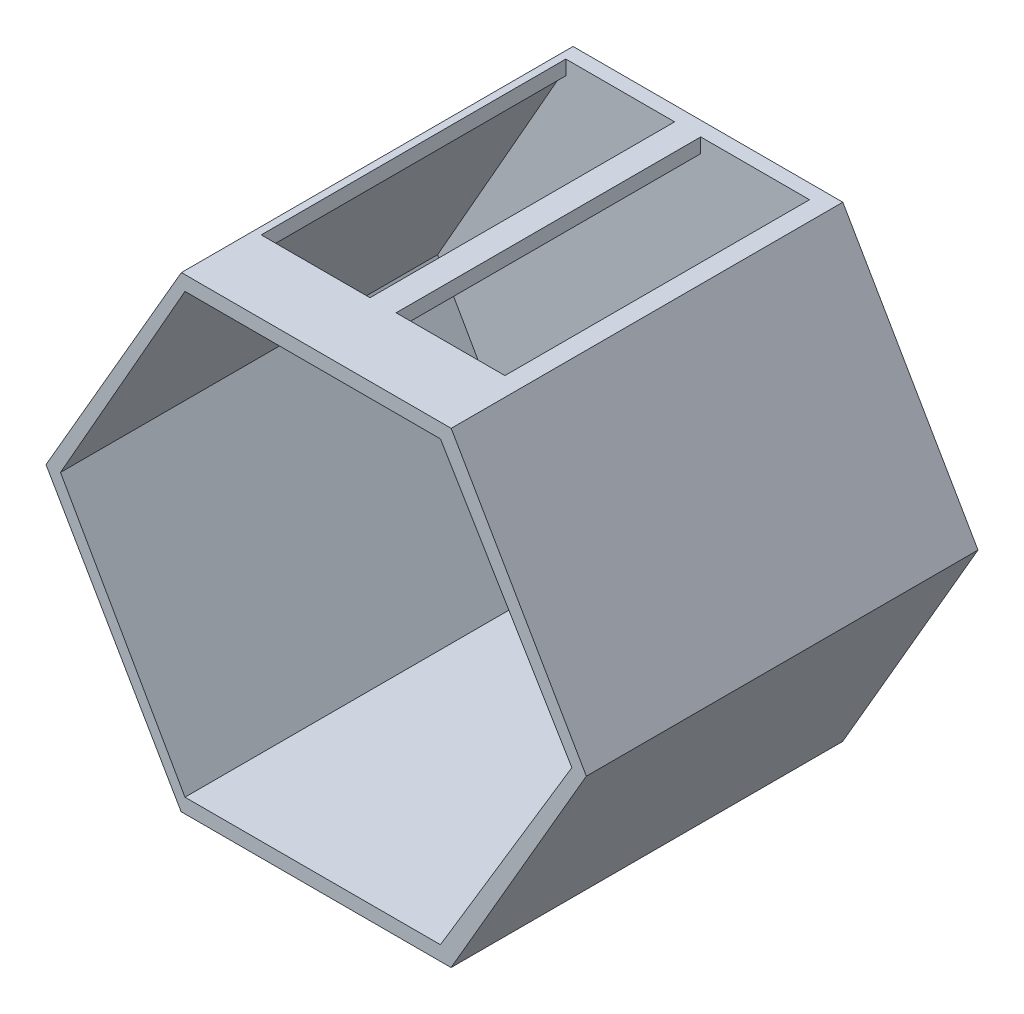
ISO-10303-21;
HEADER;
FILE_DESCRIPTION(('STEP AP214'),'2;1');
FILE_NAME('part.step','',(''),(''),'','','');
FILE_SCHEMA(('AUTOMOTIVE_DESIGN { 1 0 10303 214 1 1 1 1 }'));
ENDSEC;
DATA;
#1=APPLICATION_CONTEXT('core data for automotive mechanical design processes');
#2=APPLICATION_PROTOCOL_DEFINITION('international standard','automotive_design',2000,#1);
#3=PRODUCT_CONTEXT('',#1,'mechanical');
#4=PRODUCT('Part','Part','',(#3));
#5=PRODUCT_RELATED_PRODUCT_CATEGORY('part','',(#4));
#6=PRODUCT_DEFINITION_FORMATION('','',#4);
#7=PRODUCT_DEFINITION_CONTEXT('part definition',#1,'design');
#8=PRODUCT_DEFINITION('design','',#6,#7);
#9=PRODUCT_DEFINITION_SHAPE('','',#8);
#10=(LENGTH_UNIT() NAMED_UNIT(*) SI_UNIT(.MILLI.,.METRE.));
#11=(NAMED_UNIT(*) PLANE_ANGLE_UNIT() SI_UNIT($,.RADIAN.));
#12=(NAMED_UNIT(*) SI_UNIT($,.STERADIAN.) SOLID_ANGLE_UNIT());
#13=UNCERTAINTY_MEASURE_WITH_UNIT(LENGTH_MEASURE(1.E-05),#10,'distance_accuracy_value','');
#14=(GEOMETRIC_REPRESENTATION_CONTEXT(3) GLOBAL_UNCERTAINTY_ASSIGNED_CONTEXT((#13)) GLOBAL_UNIT_ASSIGNED_CONTEXT((#10,
#11,#12)) REPRESENTATION_CONTEXT('',''));
#15=CARTESIAN_POINT('',(0.,0.,0.));
#16=DIRECTION('',(0.,0.,1.));
#17=DIRECTION('',(1.,0.,0.));
#18=AXIS2_PLACEMENT_3D('',#15,#16,#17);
#19=CARTESIAN_POINT('',(928.607799475483,-1610.,0.));
#20=DIRECTION('',(0.865126276195594,-0.501554110975022,0.));
#21=DIRECTION('',(0.501554110975022,0.865126276195594,0.));
#22=AXIS2_PLACEMENT_3D('',#19,#20,#21);
#23=PLANE('',#22);
#24=DIRECTION('',(0.501554110975022,0.865126276195594,0.));
#25=VECTOR('',#24,1.);
#26=CARTESIAN_POINT('',(1395.05363222758,-805.431684227843,2700.));
#27=LINE('',#26,#25);
#28=CARTESIAN_POINT('',(928.607799475483,-1610.,2700.));
#29=VERTEX_POINT('',#28);
#30=CARTESIAN_POINT('',(1861.49946497968,-0.863368455684849,2700.));
#31=VERTEX_POINT('',#30);
#32=EDGE_CURVE('E9',#29,#31,#27,.T.);
#33=ORIENTED_EDGE('',*,*,#32,.F.);
#34=DIRECTION('',(0.,0.,1.));
#35=VECTOR('',#34,1.);
#36=CARTESIAN_POINT('',(928.607799475483,-1610.,1350.));
#37=LINE('',#36,#35);
#38=CARTESIAN_POINT('',(928.607799475483,-1610.,0.));
#39=VERTEX_POINT('',#38);
#40=EDGE_CURVE('E26',#39,#29,#37,.T.);
#41=ORIENTED_EDGE('',*,*,#40,.F.);
#42=DIRECTION('',(0.501554110975022,0.865126276195594,0.));
#43=VECTOR('',#42,1.);
#44=CARTESIAN_POINT('',(1395.05363222758,-805.431684227843,0.));
#45=LINE('',#44,#43);
#46=CARTESIAN_POINT('',(1861.49946497968,-0.863368455684849,0.));
#47=VERTEX_POINT('',#46);
#48=EDGE_CURVE('E381',#39,#47,#45,.T.);
#49=ORIENTED_EDGE('',*,*,#48,.T.);
#50=DIRECTION('',(0.,0.,1.));
#51=VECTOR('',#50,1.);
#52=CARTESIAN_POINT('',(1861.49946497968,-0.863368455684849,1350.));
#53=LINE('',#52,#51);
#54=EDGE_CURVE('E35',#47,#31,#53,.T.);
#55=ORIENTED_EDGE('',*,*,#54,.T.);
#56=EDGE_LOOP('',(#33,#41,#49,#55));
#57=FACE_BOUND('',#56,.T.);
#58=ADVANCED_FACE('F15',(#57),#23,.T.);
#59=CARTESIAN_POINT('',(1861.49946497968,-0.863368455685077,0.));
#60=DIRECTION('',(0.865591397849462,0.500750968016052,0.));
#61=DIRECTION('',(-0.500750968016052,0.865591397849462,0.));
#62=AXIS2_PLACEMENT_3D('',#59,#60,#61);
#63=PLANE('',#62);
#64=DIRECTION('',(-0.500750968016052,0.865591397849462,0.));
#65=VECTOR('',#64,1.);
#66=CARTESIAN_POINT('',(1395.55133223491,804.568315772158,2700.));
#67=LINE('',#66,#65);
#68=CARTESIAN_POINT('',(929.603199490142,1610.,2700.));
#69=VERTEX_POINT('',#68);
#70=EDGE_CURVE('E402',#31,#69,#67,.T.);
#71=ORIENTED_EDGE('',*,*,#70,.F.);
#72=ORIENTED_EDGE('',*,*,#54,.F.);
#73=DIRECTION('',(-0.500750968016052,0.865591397849462,0.));
#74=VECTOR('',#73,1.);
#75=CARTESIAN_POINT('',(1395.55133223491,804.568315772158,0.));
#76=LINE('',#75,#74);
#77=CARTESIAN_POINT('',(929.603199490142,1610.,0.));
#78=VERTEX_POINT('',#77);
#79=EDGE_CURVE('E365',#47,#78,#76,.T.);
#80=ORIENTED_EDGE('',*,*,#79,.T.);
#81=DIRECTION('',(0.,0.,1.));
#82=VECTOR('',#81,1.);
#83=CARTESIAN_POINT('',(929.603199490142,1610.,1350.));
#84=LINE('',#83,#82);
#85=EDGE_CURVE('E233',#78,#69,#84,.T.);
#86=ORIENTED_EDGE('',*,*,#85,.T.);
#87=EDGE_LOOP('',(#71,#72,#80,#86));
#88=FACE_BOUND('',#87,.T.);
#89=ADVANCED_FACE('F418',(#88),#63,.T.);
#90=CARTESIAN_POINT('',(-930.396800509857,1610.,0.));
#91=DIRECTION('',(-0.865591397849462,0.500750968016053,0.));
#92=DIRECTION('',(-0.500750968016053,-0.865591397849462,0.));
#93=AXIS2_PLACEMENT_3D('',#90,#91,#92);
#94=PLANE('',#93);
#95=DIRECTION('',(-0.500750968016053,-0.865591397849462,0.));
#96=VECTOR('',#95,1.);
#97=CARTESIAN_POINT('',(-1397.09183319256,803.277234570871,2700.));
#98=LINE('',#97,#96);
#99=CARTESIAN_POINT('',(-930.396800509857,1610.,2700.));
#100=VERTEX_POINT('',#99);
#101=CARTESIAN_POINT('',(-1863.78686587527,-3.44553085825828,2700.));
#102=VERTEX_POINT('',#101);
#103=EDGE_CURVE('E389',#100,#102,#98,.T.);
#104=ORIENTED_EDGE('',*,*,#103,.F.);
#105=DIRECTION('',(0.,0.,1.));
#106=VECTOR('',#105,1.);
#107=CARTESIAN_POINT('',(-930.396800509857,1610.,1350.));
#108=LINE('',#107,#106);
#109=CARTESIAN_POINT('',(-930.396800509857,1610.,0.));
#110=VERTEX_POINT('',#109);
#111=EDGE_CURVE('E386',#110,#100,#108,.T.);
#112=ORIENTED_EDGE('',*,*,#111,.F.);
#113=DIRECTION('',(-0.500750968016053,-0.865591397849462,0.));
#114=VECTOR('',#113,1.);
#115=CARTESIAN_POINT('',(-1397.09183319256,803.277234570871,0.));
#116=LINE('',#115,#114);
#117=CARTESIAN_POINT('',(-1863.78686587527,-3.44553085825828,0.));
#118=VERTEX_POINT('',#117);
#119=EDGE_CURVE('E366',#110,#118,#116,.T.);
#120=ORIENTED_EDGE('',*,*,#119,.T.);
#121=DIRECTION('',(0.,0.,1.));
#122=VECTOR('',#121,1.);
#123=CARTESIAN_POINT('',(-1863.78686587527,-3.44553085825828,1350.));
#124=LINE('',#123,#122);
#125=EDGE_CURVE('E375',#118,#102,#124,.T.);
#126=ORIENTED_EDGE('',*,*,#125,.T.);
#127=EDGE_LOOP('',(#104,#112,#120,#126));
#128=FACE_BOUND('',#127,.T.);
#129=ADVANCED_FACE('F439',(#128),#94,.T.);
#130=CARTESIAN_POINT('',(-1863.78686587527,-3.44553085825771,0.));
#131=DIRECTION('',(-0.865126276195594,-0.501554110975023,0.));
#132=DIRECTION('',(0.501554110975023,-0.865126276195594,0.));
#133=AXIS2_PLACEMENT_3D('',#130,#131,#132);
#134=PLANE('',#133);
#135=DIRECTION('',(0.501554110975023,-0.865126276195594,0.));
#136=VECTOR('',#135,1.);
#137=CARTESIAN_POINT('',(-1398.08953319989,-806.722765429129,2700.));
#138=LINE('',#137,#136);
#139=CARTESIAN_POINT('',(-932.392200524518,-1610.,2700.));
#140=VERTEX_POINT('',#139);
#141=EDGE_CURVE('E382',#102,#140,#138,.T.);
#142=ORIENTED_EDGE('',*,*,#141,.F.);
#143=ORIENTED_EDGE('',*,*,#125,.F.);
#144=DIRECTION('',(0.501554110975023,-0.865126276195594,0.));
#145=VECTOR('',#144,1.);
#146=CARTESIAN_POINT('',(-1398.08953319989,-806.722765429129,0.));
#147=LINE('',#146,#145);
#148=CARTESIAN_POINT('',(-932.392200524518,-1610.,0.));
#149=VERTEX_POINT('',#148);
#150=EDGE_CURVE('E370',#118,#149,#147,.T.);
#151=ORIENTED_EDGE('',*,*,#150,.T.);
#152=DIRECTION('',(0.,0.,1.));
#153=VECTOR('',#152,1.);
#154=CARTESIAN_POINT('',(-932.392200524517,-1610.,1350.));
#155=LINE('',#154,#153);
#156=EDGE_CURVE('E376',#149,#140,#155,.T.);
#157=ORIENTED_EDGE('',*,*,#156,.T.);
#158=EDGE_LOOP('',(#142,#143,#151,#157));
#159=FACE_BOUND('',#158,.T.);
#160=ADVANCED_FACE('F437',(#159),#134,.T.);
#161=CARTESIAN_POINT('',(-932.392200524517,-1610.,0.));
#162=DIRECTION('',(0.,-1.,0.));
#163=DIRECTION('',(0.,0.,-1.));
#164=AXIS2_PLACEMENT_3D('',#161,#162,#163);
#165=PLANE('',#164);
#166=DIRECTION('',(1.,0.,0.));
#167=VECTOR('',#166,1.);
#168=CARTESIAN_POINT('',(-1.89220052451708,-1610.,2700.));
#169=LINE('',#168,#167);
#170=EDGE_CURVE('E371',#140,#29,#169,.T.);
#171=ORIENTED_EDGE('',*,*,#170,.F.);
#172=ORIENTED_EDGE('',*,*,#156,.F.);
#173=DIRECTION('',(1.,0.,0.));
#174=VECTOR('',#173,1.);
#175=CARTESIAN_POINT('',(-1.89220052451708,-1610.,0.));
#176=LINE('',#175,#174);
#177=EDGE_CURVE('E338',#149,#39,#176,.T.);
#178=ORIENTED_EDGE('',*,*,#177,.T.);
#179=ORIENTED_EDGE('',*,*,#40,.T.);
#180=EDGE_LOOP('',(#171,#172,#178,#179));
#181=FACE_BOUND('',#180,.T.);
#182=ADVANCED_FACE('F432',(#181),#165,.T.);
#183=CARTESIAN_POINT('',(0.,0.,0.));
#184=DIRECTION('',(0.,0.,1.));
#185=DIRECTION('',(1.,0.,0.));
#186=AXIS2_PLACEMENT_3D('',#183,#184,#185);
#187=PLANE('',#186);
#188=ORIENTED_EDGE('',*,*,#48,.F.);
#189=ORIENTED_EDGE('',*,*,#177,.F.);
#190=ORIENTED_EDGE('',*,*,#150,.F.);
#191=ORIENTED_EDGE('',*,*,#119,.F.);
#192=DIRECTION('',(-1.,0.,0.));
#193=VECTOR('',#192,1.);
#194=CARTESIAN_POINT('',(-0.39680050985794,1610.,0.));
#195=LINE('',#194,#193);
#196=EDGE_CURVE('E361',#78,#110,#195,.T.);
#197=ORIENTED_EDGE('',*,*,#196,.F.);
#198=ORIENTED_EDGE('',*,*,#79,.F.);
#199=EDGE_LOOP('',(#188,#189,#190,#191,#197,#198));
#200=FACE_BOUND('',#199,.T.);
#201=ADVANCED_FACE('F420',(#200),#187,.F.);
#202=CARTESIAN_POINT('',(0.,0.,2700.));
#203=DIRECTION('',(0.,0.,1.));
#204=DIRECTION('',(1.,0.,0.));
#205=AXIS2_PLACEMENT_3D('',#202,#203,#204);
#206=PLANE('',#205);
#207=ORIENTED_EDGE('',*,*,#170,.T.);
#208=ORIENTED_EDGE('',*,*,#32,.T.);
#209=ORIENTED_EDGE('',*,*,#70,.T.);
#210=DIRECTION('',(-1.,0.,0.));
#211=VECTOR('',#210,1.);
#212=CARTESIAN_POINT('',(-0.39680050985794,1610.,2700.));
#213=LINE('',#212,#211);
#214=EDGE_CURVE('E228',#69,#100,#213,.T.);
#215=ORIENTED_EDGE('',*,*,#214,.T.);
#216=ORIENTED_EDGE('',*,*,#103,.T.);
#217=ORIENTED_EDGE('',*,*,#141,.T.);
#218=EDGE_LOOP('',(#207,#208,#209,#215,#216,#217));
#219=FACE_BOUND('',#218,.T.);
#220=DIRECTION('',(-0.514538382384003,0.857467348097672,0.));
#221=VECTOR('',#220,1.);
#222=CARTESIAN_POINT('',(1308.45214638547,755.000000000001,2700.));
#223=LINE('',#222,#221);
#224=CARTESIAN_POINT('',(1761.50319207459,2.27373675443232E-12,2700.));
#225=VERTEX_POINT('',#224);
#226=CARTESIAN_POINT('',(855.401100696359,1510.,2700.));
#227=VERTEX_POINT('',#226);
#228=EDGE_CURVE('E335',#225,#227,#223,.T.);
#229=ORIENTED_EDGE('',*,*,#228,.F.);
#230=DIRECTION('',(0.514538382384003,0.857467348097672,0.));
#231=VECTOR('',#230,1.);
#232=CARTESIAN_POINT('',(1308.45214638547,-755.,2700.));
#233=LINE('',#232,#231);
#234=CARTESIAN_POINT('',(855.401100696358,-1510.,2700.));
#235=VERTEX_POINT('',#234);
#236=EDGE_CURVE('E291',#235,#225,#233,.T.);
#237=ORIENTED_EDGE('',*,*,#236,.F.);
#238=DIRECTION('',(1.,0.,0.));
#239=VECTOR('',#238,1.);
#240=CARTESIAN_POINT('',(-25.0988993036411,-1510.,2700.));
#241=LINE('',#240,#239);
#242=CARTESIAN_POINT('',(-905.598899303641,-1510.,2700.));
#243=VERTEX_POINT('',#242);
#244=EDGE_CURVE('E296',#243,#235,#241,.T.);
#245=ORIENTED_EDGE('',*,*,#244,.F.);
#246=DIRECTION('',(0.494136839848881,-0.869384140356932,0.));
#247=VECTOR('',#246,1.);
#248=CARTESIAN_POINT('',(-1334.72257061048,-755.,2700.));
#249=LINE('',#248,#247);
#250=CARTESIAN_POINT('',(-1763.84624191732,0.,2700.));
#251=VERTEX_POINT('',#250);
#252=EDGE_CURVE('E351',#251,#243,#249,.T.);
#253=ORIENTED_EDGE('',*,*,#252,.F.);
#254=DIRECTION('',(-0.494136839848882,-0.869384140356932,0.));
#255=VECTOR('',#254,1.);
#256=CARTESIAN_POINT('',(-1334.72257061048,755.,2700.));
#257=LINE('',#256,#255);
#258=CARTESIAN_POINT('',(-905.59889930364,1510.,2700.));
#259=VERTEX_POINT('',#258);
#260=EDGE_CURVE('E342',#259,#251,#257,.T.);
#261=ORIENTED_EDGE('',*,*,#260,.F.);
#262=DIRECTION('',(-1.,0.,0.));
#263=VECTOR('',#262,1.);
#264=CARTESIAN_POINT('',(-25.0988993036407,1510.,2700.));
#265=LINE('',#264,#263);
#266=EDGE_CURVE('E339',#227,#259,#265,.T.);
#267=ORIENTED_EDGE('',*,*,#266,.F.);
#268=EDGE_LOOP('',(#229,#237,#245,#253,#261,#267));
#269=FACE_BOUND('',#268,.T.);
#270=ADVANCED_FACE('F429',(#219,#269),#206,.T.);
#271=CARTESIAN_POINT('',(1761.50319207459,2.27373675443232E-12,2700.));
#272=DIRECTION('',(-0.857467348097672,-0.514538382384003,0.));
#273=DIRECTION('',(0.514538382384003,-0.857467348097672,0.));
#274=AXIS2_PLACEMENT_3D('',#271,#272,#273);
#275=PLANE('',#274);
#276=DIRECTION('',(-0.514538382384003,0.857467348097672,0.));
#277=VECTOR('',#276,1.);
#278=CARTESIAN_POINT('',(1308.45214638547,755.000000000001,100.));
#279=LINE('',#278,#277);
#280=CARTESIAN_POINT('',(1761.50319207459,-1.13686837721616E-13,100.));
#281=VERTEX_POINT('',#280);
#282=CARTESIAN_POINT('',(855.401100696359,1510.,100.));
#283=VERTEX_POINT('',#282);
#284=EDGE_CURVE('E284',#281,#283,#279,.T.);
#285=ORIENTED_EDGE('',*,*,#284,.F.);
#286=DIRECTION('',(0.,0.,-1.));
#287=VECTOR('',#286,1.);
#288=CARTESIAN_POINT('',(1761.50319207459,2.27373675443232E-12,1400.));
#289=LINE('',#288,#287);
#290=EDGE_CURVE('E292',#225,#281,#289,.T.);
#291=ORIENTED_EDGE('',*,*,#290,.F.);
#292=ORIENTED_EDGE('',*,*,#228,.T.);
#293=DIRECTION('',(0.,0.,-1.));
#294=VECTOR('',#293,1.);
#295=CARTESIAN_POINT('',(855.401100696359,1510.,1400.));
#296=LINE('',#295,#294);
#297=EDGE_CURVE('E173',#227,#283,#296,.T.);
#298=ORIENTED_EDGE('',*,*,#297,.T.);
#299=EDGE_LOOP('',(#285,#291,#292,#298));
#300=FACE_BOUND('',#299,.T.);
#301=ADVANCED_FACE('F334',(#300),#275,.T.);
#302=CARTESIAN_POINT('',(-905.59889930364,1510.,2700.));
#303=DIRECTION('',(0.869384140356932,-0.494136839848882,0.));
#304=DIRECTION('',(0.494136839848882,0.869384140356932,0.));
#305=AXIS2_PLACEMENT_3D('',#302,#303,#304);
#306=PLANE('',#305);
#307=DIRECTION('',(-0.494136839848882,-0.869384140356931,0.));
#308=VECTOR('',#307,1.);
#309=CARTESIAN_POINT('',(-1334.72257061048,755.,100.));
#310=LINE('',#309,#308);
#311=CARTESIAN_POINT('',(-905.598899303641,1510.,100.));
#312=VERTEX_POINT('',#311);
#313=CARTESIAN_POINT('',(-1763.84624191732,-6.82121026329696E-13,100.));
#314=VERTEX_POINT('',#313);
#315=EDGE_CURVE('E299',#312,#314,#310,.T.);
#316=ORIENTED_EDGE('',*,*,#315,.F.);
#317=DIRECTION('',(0.,0.,-1.));
#318=VECTOR('',#317,1.);
#319=CARTESIAN_POINT('',(-905.59889930364,1510.,1400.));
#320=LINE('',#319,#318);
#321=EDGE_CURVE('E167',#259,#312,#320,.T.);
#322=ORIENTED_EDGE('',*,*,#321,.F.);
#323=ORIENTED_EDGE('',*,*,#260,.T.);
#324=DIRECTION('',(0.,0.,-1.));
#325=VECTOR('',#324,1.);
#326=CARTESIAN_POINT('',(-1763.84624191732,-1.13686837721616E-12,1400.));
#327=LINE('',#326,#325);
#328=EDGE_CURVE('E306',#251,#314,#327,.T.);
#329=ORIENTED_EDGE('',*,*,#328,.T.);
#330=EDGE_LOOP('',(#316,#322,#323,#329));
#331=FACE_BOUND('',#330,.T.);
#332=ADVANCED_FACE('F346',(#331),#306,.T.);
#333=CARTESIAN_POINT('',(855.401100696358,-1510.,2700.));
#334=DIRECTION('',(-0.857467348097672,0.514538382384003,0.));
#335=DIRECTION('',(-0.514538382384003,-0.857467348097672,0.));
#336=AXIS2_PLACEMENT_3D('',#333,#334,#335);
#337=PLANE('',#336);
#338=DIRECTION('',(0.514538382384003,0.857467348097672,0.));
#339=VECTOR('',#338,1.);
#340=CARTESIAN_POINT('',(1308.45214638547,-755.000000000001,100.));
#341=LINE('',#340,#339);
#342=CARTESIAN_POINT('',(855.401100696359,-1510.,100.));
#343=VERTEX_POINT('',#342);
#344=EDGE_CURVE('E287',#343,#281,#341,.T.);
#345=ORIENTED_EDGE('',*,*,#344,.F.);
#346=DIRECTION('',(0.,0.,-1.));
#347=VECTOR('',#346,1.);
#348=CARTESIAN_POINT('',(855.401100696358,-1510.,1400.));
#349=LINE('',#348,#347);
#350=EDGE_CURVE('E315',#235,#343,#349,.T.);
#351=ORIENTED_EDGE('',*,*,#350,.F.);
#352=ORIENTED_EDGE('',*,*,#236,.T.);
#353=ORIENTED_EDGE('',*,*,#290,.T.);
#354=EDGE_LOOP('',(#345,#351,#352,#353));
#355=FACE_BOUND('',#354,.T.);
#356=ADVANCED_FACE('F331',(#355),#337,.T.);
#357=CARTESIAN_POINT('',(-1763.84624191732,0.,2700.));
#358=DIRECTION('',(0.869384140356932,0.494136839848881,0.));
#359=DIRECTION('',(-0.494136839848881,0.869384140356932,0.));
#360=AXIS2_PLACEMENT_3D('',#357,#358,#359);
#361=PLANE('',#360);
#362=DIRECTION('',(0.494136839848881,-0.869384140356932,0.));
#363=VECTOR('',#362,1.);
#364=CARTESIAN_POINT('',(-1334.72257061048,-755.,100.));
#365=LINE('',#364,#363);
#366=CARTESIAN_POINT('',(-905.598899303641,-1510.,100.));
#367=VERTEX_POINT('',#366);
#368=EDGE_CURVE('E309',#314,#367,#365,.T.);
#369=ORIENTED_EDGE('',*,*,#368,.F.);
#370=ORIENTED_EDGE('',*,*,#328,.F.);
#371=ORIENTED_EDGE('',*,*,#252,.T.);
#372=DIRECTION('',(0.,0.,-1.));
#373=VECTOR('',#372,1.);
#374=CARTESIAN_POINT('',(-905.598899303641,-1510.,1400.));
#375=LINE('',#374,#373);
#376=EDGE_CURVE('E205',#243,#367,#375,.T.);
#377=ORIENTED_EDGE('',*,*,#376,.T.);
#378=EDGE_LOOP('',(#369,#370,#371,#377));
#379=FACE_BOUND('',#378,.T.);
#380=ADVANCED_FACE('F349',(#379),#361,.T.);
#381=CARTESIAN_POINT('',(-905.598899303641,-1510.,2700.));
#382=DIRECTION('',(0.,1.,0.));
#383=DIRECTION('',(0.,0.,1.));
#384=AXIS2_PLACEMENT_3D('',#381,#382,#383);
#385=PLANE('',#384);
#386=DIRECTION('',(1.,0.,0.));
#387=VECTOR('',#386,1.);
#388=CARTESIAN_POINT('',(-25.0988993036411,-1510.,100.));
#389=LINE('',#388,#387);
#390=EDGE_CURVE('E310',#367,#343,#389,.T.);
#391=ORIENTED_EDGE('',*,*,#390,.F.);
#392=ORIENTED_EDGE('',*,*,#376,.F.);
#393=ORIENTED_EDGE('',*,*,#244,.T.);
#394=ORIENTED_EDGE('',*,*,#350,.T.);
#395=EDGE_LOOP('',(#391,#392,#393,#394));
#396=FACE_BOUND('',#395,.T.);
#397=ADVANCED_FACE('F327',(#396),#385,.T.);
#398=CARTESIAN_POINT('',(800.,1610.,2200.));
#399=DIRECTION('',(-1.,0.,0.));
#400=DIRECTION('',(0.,0.,1.));
#401=AXIS2_PLACEMENT_3D('',#398,#399,#400);
#402=PLANE('',#401);
#403=DIRECTION('',(0.,0.,1.));
#404=VECTOR('',#403,1.);
#405=CARTESIAN_POINT('',(800.,1510.,1150.));
#406=LINE('',#405,#404);
#407=CARTESIAN_POINT('',(800.,1510.,100.));
#408=VERTEX_POINT('',#407);
#409=CARTESIAN_POINT('',(800.,1510.,2200.));
#410=VERTEX_POINT('',#409);
#411=EDGE_CURVE('E195',#408,#410,#406,.T.);
#412=ORIENTED_EDGE('',*,*,#411,.T.);
#413=DIRECTION('',(0.,-1.,0.));
#414=VECTOR('',#413,1.);
#415=CARTESIAN_POINT('',(800.,1560.,2200.));
#416=LINE('',#415,#414);
#417=CARTESIAN_POINT('',(800.,1610.,2200.));
#418=VERTEX_POINT('',#417);
#419=EDGE_CURVE('E201',#418,#410,#416,.T.);
#420=ORIENTED_EDGE('',*,*,#419,.F.);
#421=DIRECTION('',(0.,0.,-1.));
#422=VECTOR('',#421,1.);
#423=CARTESIAN_POINT('',(800.,1610.,1150.));
#424=LINE('',#423,#422);
#425=CARTESIAN_POINT('',(800.,1610.,100.));
#426=VERTEX_POINT('',#425);
#427=EDGE_CURVE('E197',#418,#426,#424,.T.);
#428=ORIENTED_EDGE('',*,*,#427,.T.);
#429=DIRECTION('',(0.,-1.,0.));
#430=VECTOR('',#429,1.);
#431=CARTESIAN_POINT('',(800.,1560.,100.));
#432=LINE('',#431,#430);
#433=EDGE_CURVE('E179',#426,#408,#432,.T.);
#434=ORIENTED_EDGE('',*,*,#433,.T.);
#435=EDGE_LOOP('',(#412,#420,#428,#434));
#436=FACE_BOUND('',#435,.T.);
#437=ADVANCED_FACE('F529',(#436),#402,.T.);
#438=CARTESIAN_POINT('',(50.,1610.,2200.));
#439=DIRECTION('',(0.,0.,-1.));
#440=DIRECTION('',(-1.,0.,0.));
#441=AXIS2_PLACEMENT_3D('',#438,#439,#440);
#442=PLANE('',#441);
#443=DIRECTION('',(1.,0.,0.));
#444=VECTOR('',#443,1.);
#445=CARTESIAN_POINT('',(425.,1510.,2200.));
#446=LINE('',#445,#444);
#447=CARTESIAN_POINT('',(50.,1510.,2200.));
#448=VERTEX_POINT('',#447);
#449=EDGE_CURVE('E206',#448,#410,#446,.T.);
#450=ORIENTED_EDGE('',*,*,#449,.F.);
#451=DIRECTION('',(0.,-1.,0.));
#452=VECTOR('',#451,1.);
#453=CARTESIAN_POINT('',(50.,1560.,2200.));
#454=LINE('',#453,#452);
#455=CARTESIAN_POINT('',(50.,1610.,2200.));
#456=VERTEX_POINT('',#455);
#457=EDGE_CURVE('E210',#456,#448,#454,.T.);
#458=ORIENTED_EDGE('',*,*,#457,.F.);
#459=DIRECTION('',(1.,0.,0.));
#460=VECTOR('',#459,1.);
#461=CARTESIAN_POINT('',(425.,1610.,2200.));
#462=LINE('',#461,#460);
#463=EDGE_CURVE('E211',#456,#418,#462,.T.);
#464=ORIENTED_EDGE('',*,*,#463,.T.);
#465=ORIENTED_EDGE('',*,*,#419,.T.);
#466=EDGE_LOOP('',(#450,#458,#464,#465));
#467=FACE_BOUND('',#466,.T.);
#468=ADVANCED_FACE('F277',(#467),#442,.T.);
#469=CARTESIAN_POINT('',(50.,1610.,100.));
#470=DIRECTION('',(1.,0.,0.));
#471=DIRECTION('',(0.,0.,-1.));
#472=AXIS2_PLACEMENT_3D('',#469,#470,#471);
#473=PLANE('',#472);
#474=DIRECTION('',(0.,0.,1.));
#475=VECTOR('',#474,1.);
#476=CARTESIAN_POINT('',(50.,1510.,1150.));
#477=LINE('',#476,#475);
#478=CARTESIAN_POINT('',(50.,1510.,100.));
#479=VERTEX_POINT('',#478);
#480=EDGE_CURVE('E218',#479,#448,#477,.T.);
#481=ORIENTED_EDGE('',*,*,#480,.F.);
#482=DIRECTION('',(0.,-1.,0.));
#483=VECTOR('',#482,1.);
#484=CARTESIAN_POINT('',(50.,1560.,100.));
#485=LINE('',#484,#483);
#486=CARTESIAN_POINT('',(50.,1610.,100.));
#487=VERTEX_POINT('',#486);
#488=EDGE_CURVE('E222',#487,#479,#485,.T.);
#489=ORIENTED_EDGE('',*,*,#488,.F.);
#490=DIRECTION('',(0.,0.,1.));
#491=VECTOR('',#490,1.);
#492=CARTESIAN_POINT('',(50.,1610.,1150.));
#493=LINE('',#492,#491);
#494=EDGE_CURVE('E215',#487,#456,#493,.T.);
#495=ORIENTED_EDGE('',*,*,#494,.T.);
#496=ORIENTED_EDGE('',*,*,#457,.T.);
#497=EDGE_LOOP('',(#481,#489,#495,#496));
#498=FACE_BOUND('',#497,.T.);
#499=ADVANCED_FACE('F273',(#498),#473,.T.);
#500=CARTESIAN_POINT('',(929.603199490141,1610.,0.));
#501=DIRECTION('',(0.,1.,0.));
#502=DIRECTION('',(0.,0.,1.));
#503=AXIS2_PLACEMENT_3D('',#500,#501,#502);
#504=PLANE('',#503);
#505=ORIENTED_EDGE('',*,*,#214,.F.);
#506=ORIENTED_EDGE('',*,*,#85,.F.);
#507=ORIENTED_EDGE('',*,*,#196,.T.);
#508=ORIENTED_EDGE('',*,*,#111,.T.);
#509=EDGE_LOOP('',(#505,#506,#507,#508));
#510=FACE_BOUND('',#509,.T.);
#511=DIRECTION('',(0.,0.,-1.));
#512=VECTOR('',#511,1.);
#513=CARTESIAN_POINT('',(-130.,1610.,1150.));
#514=LINE('',#513,#512);
#515=CARTESIAN_POINT('',(-130.,1610.,2200.));
#516=VERTEX_POINT('',#515);
#517=CARTESIAN_POINT('',(-130.,1610.,100.));
#518=VERTEX_POINT('',#517);
#519=EDGE_CURVE('E229',#516,#518,#514,.T.);
#520=ORIENTED_EDGE('',*,*,#519,.F.);
#521=DIRECTION('',(1.,0.,0.));
#522=VECTOR('',#521,1.);
#523=CARTESIAN_POINT('',(-505.,1610.,2200.));
#524=LINE('',#523,#522);
#525=CARTESIAN_POINT('',(-880.,1610.,2200.));
#526=VERTEX_POINT('',#525);
#527=EDGE_CURVE('E199',#526,#516,#524,.T.);
#528=ORIENTED_EDGE('',*,*,#527,.F.);
#529=DIRECTION('',(0.,0.,1.));
#530=VECTOR('',#529,1.);
#531=CARTESIAN_POINT('',(-880.,1610.,1150.));
#532=LINE('',#531,#530);
#533=CARTESIAN_POINT('',(-880.,1610.,100.));
#534=VERTEX_POINT('',#533);
#535=EDGE_CURVE('E236',#534,#526,#532,.T.);
#536=ORIENTED_EDGE('',*,*,#535,.F.);
#537=DIRECTION('',(-1.,0.,0.));
#538=VECTOR('',#537,1.);
#539=CARTESIAN_POINT('',(-505.,1610.,100.));
#540=LINE('',#539,#538);
#541=EDGE_CURVE('E177',#518,#534,#540,.T.);
#542=ORIENTED_EDGE('',*,*,#541,.F.);
#543=EDGE_LOOP('',(#520,#528,#536,#542));
#544=FACE_BOUND('',#543,.T.);
#545=ORIENTED_EDGE('',*,*,#427,.F.);
#546=ORIENTED_EDGE('',*,*,#463,.F.);
#547=ORIENTED_EDGE('',*,*,#494,.F.);
#548=DIRECTION('',(-1.,0.,0.));
#549=VECTOR('',#548,1.);
#550=CARTESIAN_POINT('',(425.,1610.,100.));
#551=LINE('',#550,#549);
#552=EDGE_CURVE('E200',#426,#487,#551,.T.);
#553=ORIENTED_EDGE('',*,*,#552,.F.);
#554=EDGE_LOOP('',(#545,#546,#547,#553));
#555=FACE_BOUND('',#554,.T.);
#556=ADVANCED_FACE('F425',(#510,#544,#555),#504,.T.);
#557=CARTESIAN_POINT('',(855.401100696359,1510.,2700.));
#558=DIRECTION('',(0.,-1.,0.));
#559=DIRECTION('',(0.,0.,-1.));
#560=AXIS2_PLACEMENT_3D('',#557,#558,#559);
#561=PLANE('',#560);
#562=DIRECTION('',(0.,0.,1.));
#563=VECTOR('',#562,1.);
#564=CARTESIAN_POINT('',(-130.,1510.,1150.));
#565=LINE('',#564,#563);
#566=CARTESIAN_POINT('',(-130.,1510.,100.));
#567=VERTEX_POINT('',#566);
#568=CARTESIAN_POINT('',(-130.,1510.,2200.));
#569=VERTEX_POINT('',#568);
#570=EDGE_CURVE('E172',#567,#569,#565,.T.);
#571=ORIENTED_EDGE('',*,*,#570,.F.);
#572=DIRECTION('',(-1.,0.,0.));
#573=VECTOR('',#572,1.);
#574=CARTESIAN_POINT('',(-40.0000000000002,1510.,100.));
#575=LINE('',#574,#573);
#576=EDGE_CURVE('E255',#479,#567,#575,.T.);
#577=ORIENTED_EDGE('',*,*,#576,.F.);
#578=ORIENTED_EDGE('',*,*,#480,.T.);
#579=ORIENTED_EDGE('',*,*,#449,.T.);
#580=ORIENTED_EDGE('',*,*,#411,.F.);
#581=DIRECTION('',(-1.,0.,0.));
#582=VECTOR('',#581,1.);
#583=CARTESIAN_POINT('',(827.70055034818,1510.,100.));
#584=LINE('',#583,#582);
#585=EDGE_CURVE('E251',#283,#408,#584,.T.);
#586=ORIENTED_EDGE('',*,*,#585,.F.);
#587=ORIENTED_EDGE('',*,*,#297,.F.);
#588=ORIENTED_EDGE('',*,*,#266,.T.);
#589=ORIENTED_EDGE('',*,*,#321,.T.);
#590=DIRECTION('',(-1.,0.,0.));
#591=VECTOR('',#590,1.);
#592=CARTESIAN_POINT('',(-892.79944965182,1510.,100.));
#593=LINE('',#592,#591);
#594=CARTESIAN_POINT('',(-880.,1510.,100.));
#595=VERTEX_POINT('',#594);
#596=EDGE_CURVE('E162',#595,#312,#593,.T.);
#597=ORIENTED_EDGE('',*,*,#596,.F.);
#598=DIRECTION('',(0.,0.,1.));
#599=VECTOR('',#598,1.);
#600=CARTESIAN_POINT('',(-880.,1510.,1150.));
#601=LINE('',#600,#599);
#602=CARTESIAN_POINT('',(-880.,1510.,2200.));
#603=VERTEX_POINT('',#602);
#604=EDGE_CURVE('E149',#595,#603,#601,.T.);
#605=ORIENTED_EDGE('',*,*,#604,.T.);
#606=DIRECTION('',(1.,0.,0.));
#607=VECTOR('',#606,1.);
#608=CARTESIAN_POINT('',(-505.,1510.,2200.));
#609=LINE('',#608,#607);
#610=EDGE_CURVE('E247',#603,#569,#609,.T.);
#611=ORIENTED_EDGE('',*,*,#610,.T.);
#612=EDGE_LOOP('',(#571,#577,#578,#579,#580,#586,#587,#588,#589,#597,#605,#611));
#613=FACE_BOUND('',#612,.T.);
#614=ADVANCED_FACE('F164',(#613),#561,.T.);
#615=CARTESIAN_POINT('',(-130.,1610.,2200.));
#616=DIRECTION('',(-1.,0.,0.));
#617=DIRECTION('',(0.,0.,1.));
#618=AXIS2_PLACEMENT_3D('',#615,#616,#617);
#619=PLANE('',#618);
#620=ORIENTED_EDGE('',*,*,#570,.T.);
#621=DIRECTION('',(0.,-1.,0.));
#622=VECTOR('',#621,1.);
#623=CARTESIAN_POINT('',(-130.,1560.,2200.));
#624=LINE('',#623,#622);
#625=EDGE_CURVE('E249',#516,#569,#624,.T.);
#626=ORIENTED_EDGE('',*,*,#625,.F.);
#627=ORIENTED_EDGE('',*,*,#519,.T.);
#628=DIRECTION('',(0.,-1.,0.));
#629=VECTOR('',#628,1.);
#630=CARTESIAN_POINT('',(-130.,1560.,100.));
#631=LINE('',#630,#629);
#632=EDGE_CURVE('E183',#518,#567,#631,.T.);
#633=ORIENTED_EDGE('',*,*,#632,.T.);
#634=EDGE_LOOP('',(#620,#626,#627,#633));
#635=FACE_BOUND('',#634,.T.);
#636=ADVANCED_FACE('F267',(#635),#619,.T.);
#637=CARTESIAN_POINT('',(50.,1610.,2200.));
#638=DIRECTION('',(0.,0.,-1.));
#639=DIRECTION('',(-1.,0.,0.));
#640=AXIS2_PLACEMENT_3D('',#637,#638,#639);
#641=PLANE('',#640);
#642=ORIENTED_EDGE('',*,*,#610,.F.);
#643=DIRECTION('',(0.,-1.,0.));
#644=VECTOR('',#643,1.);
#645=CARTESIAN_POINT('',(-880.,1560.,2200.));
#646=LINE('',#645,#644);
#647=EDGE_CURVE('E158',#526,#603,#646,.T.);
#648=ORIENTED_EDGE('',*,*,#647,.F.);
#649=ORIENTED_EDGE('',*,*,#527,.T.);
#650=ORIENTED_EDGE('',*,*,#625,.T.);
#651=EDGE_LOOP('',(#642,#648,#649,#650));
#652=FACE_BOUND('',#651,.T.);
#653=ADVANCED_FACE('F264',(#652),#641,.T.);
#654=CARTESIAN_POINT('',(-880.,1610.,100.));
#655=DIRECTION('',(1.,0.,0.));
#656=DIRECTION('',(0.,0.,-1.));
#657=AXIS2_PLACEMENT_3D('',#654,#655,#656);
#658=PLANE('',#657);
#659=ORIENTED_EDGE('',*,*,#604,.F.);
#660=DIRECTION('',(0.,-1.,0.));
#661=VECTOR('',#660,1.);
#662=CARTESIAN_POINT('',(-880.,1560.,100.));
#663=LINE('',#662,#661);
#664=EDGE_CURVE('E19',#534,#595,#663,.T.);
#665=ORIENTED_EDGE('',*,*,#664,.F.);
#666=ORIENTED_EDGE('',*,*,#535,.T.);
#667=ORIENTED_EDGE('',*,*,#647,.T.);
#668=EDGE_LOOP('',(#659,#665,#666,#667));
#669=FACE_BOUND('',#668,.T.);
#670=ADVANCED_FACE('F154',(#669),#658,.T.);
#671=CARTESIAN_POINT('',(0.,0.,100.));
#672=DIRECTION('',(0.,0.,1.));
#673=DIRECTION('',(1.,0.,0.));
#674=AXIS2_PLACEMENT_3D('',#671,#672,#673);
#675=PLANE('',#674);
#676=ORIENTED_EDGE('',*,*,#576,.T.);
#677=ORIENTED_EDGE('',*,*,#632,.F.);
#678=ORIENTED_EDGE('',*,*,#541,.T.);
#679=ORIENTED_EDGE('',*,*,#664,.T.);
#680=ORIENTED_EDGE('',*,*,#596,.T.);
#681=ORIENTED_EDGE('',*,*,#315,.T.);
#682=ORIENTED_EDGE('',*,*,#368,.T.);
#683=ORIENTED_EDGE('',*,*,#390,.T.);
#684=ORIENTED_EDGE('',*,*,#344,.T.);
#685=ORIENTED_EDGE('',*,*,#284,.T.);
#686=ORIENTED_EDGE('',*,*,#585,.T.);
#687=ORIENTED_EDGE('',*,*,#433,.F.);
#688=ORIENTED_EDGE('',*,*,#552,.T.);
#689=ORIENTED_EDGE('',*,*,#488,.T.);
#690=EDGE_LOOP('',(#676,#677,#678,#679,#680,#681,#682,#683,#684,#685,#686,#687,#688,#689));
#691=FACE_BOUND('',#690,.T.);
#692=ADVANCED_FACE('F17',(#691),#675,.T.);
#693=CLOSED_SHELL('',(#58,#89,#129,#160,#182,#201,#270,#301,#332,#356,#380,#397,#437,#468,#499,
#556,#614,#636,#653,#670,#692));
#694=MANIFOLD_SOLID_BREP('B1',#693);
#695=ADVANCED_BREP_SHAPE_REPRESENTATION('',(#18,#694),#14);
#696=SHAPE_DEFINITION_REPRESENTATION(#9,#695);
ENDSEC;
END-ISO-10303-21;
